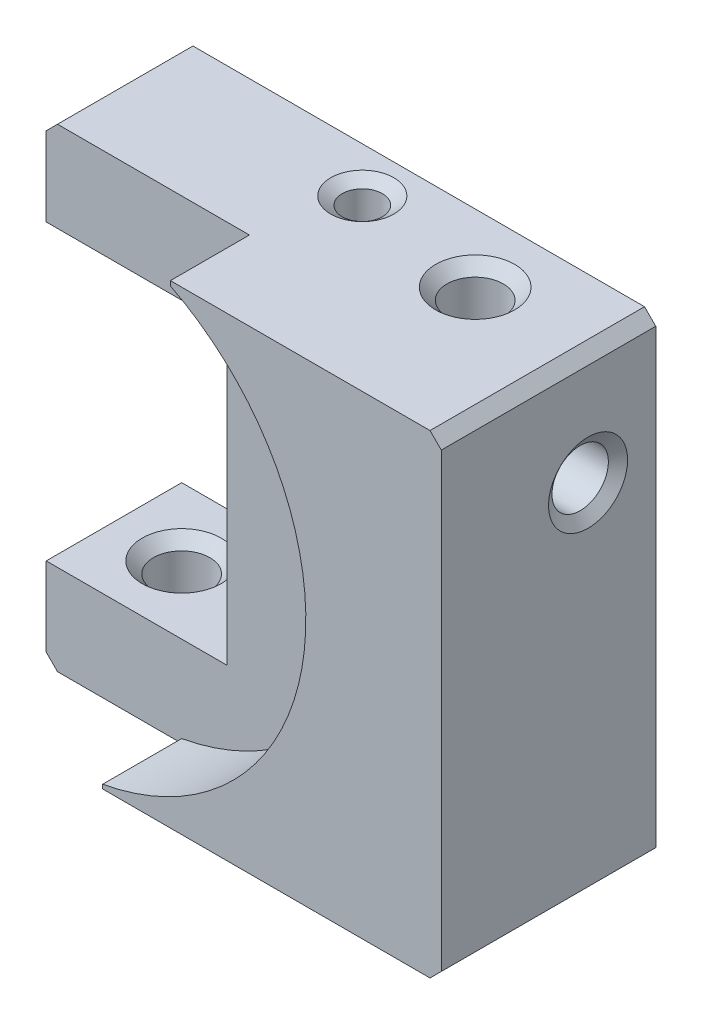
ISO-10303-21;
HEADER;
FILE_DESCRIPTION(('STEP AP214'),'2;1');
FILE_NAME('part.step','',(''),(''),'','','');
FILE_SCHEMA(('AUTOMOTIVE_DESIGN { 1 0 10303 214 1 1 1 1 }'));
ENDSEC;
DATA;
#1=APPLICATION_CONTEXT('core data for automotive mechanical design processes');
#2=APPLICATION_PROTOCOL_DEFINITION('international standard','automotive_design',2000,#1);
#3=PRODUCT_CONTEXT('',#1,'mechanical');
#4=PRODUCT('Part','Part','',(#3));
#5=PRODUCT_RELATED_PRODUCT_CATEGORY('part','',(#4));
#6=PRODUCT_DEFINITION_FORMATION('','',#4);
#7=PRODUCT_DEFINITION_CONTEXT('part definition',#1,'design');
#8=PRODUCT_DEFINITION('design','',#6,#7);
#9=PRODUCT_DEFINITION_SHAPE('','',#8);
#10=(LENGTH_UNIT() NAMED_UNIT(*) SI_UNIT(.MILLI.,.METRE.));
#11=(NAMED_UNIT(*) PLANE_ANGLE_UNIT() SI_UNIT($,.RADIAN.));
#12=(NAMED_UNIT(*) SI_UNIT($,.STERADIAN.) SOLID_ANGLE_UNIT());
#13=UNCERTAINTY_MEASURE_WITH_UNIT(LENGTH_MEASURE(1.E-05),#10,'distance_accuracy_value','');
#14=(GEOMETRIC_REPRESENTATION_CONTEXT(3) GLOBAL_UNCERTAINTY_ASSIGNED_CONTEXT((#13)) GLOBAL_UNIT_ASSIGNED_CONTEXT((#10,
#11,#12)) REPRESENTATION_CONTEXT('',''));
#15=CARTESIAN_POINT('',(0.,0.,0.));
#16=DIRECTION('',(0.,0.,1.));
#17=DIRECTION('',(1.,0.,0.));
#18=AXIS2_PLACEMENT_3D('',#15,#16,#17);
#19=CARTESIAN_POINT('',(-10.5,-10.5,9.5));
#20=DIRECTION('',(0.,1.,0.));
#21=DIRECTION('',(0.,0.,1.));
#22=AXIS2_PLACEMENT_3D('',#19,#20,#21);
#23=PLANE('',#22);
#24=CARTESIAN_POINT('',(5.5,-10.5,3.));
#25=DIRECTION('',(0.,-1.,0.));
#26=DIRECTION('',(0.,0.,-1.));
#27=AXIS2_PLACEMENT_3D('',#24,#25,#26);
#28=CIRCLE('',#27,1.75);
#29=CARTESIAN_POINT('',(5.5,-10.5,1.25));
#30=VERTEX_POINT('',#29);
#31=EDGE_CURVE('E170',#30,#30,#28,.T.);
#32=ORIENTED_EDGE('',*,*,#31,.F.);
#33=EDGE_LOOP('',(#32));
#34=FACE_BOUND('',#33,.T.);
#35=DIRECTION('',(1.,0.,0.));
#36=VECTOR('',#35,1.);
#37=CARTESIAN_POINT('',(-10.5,-10.5,0.));
#38=LINE('',#37,#36);
#39=CARTESIAN_POINT('',(-10.,-10.5,0.));
#40=VERTEX_POINT('',#39);
#41=CARTESIAN_POINT('',(10.,-10.5,0.));
#42=VERTEX_POINT('',#41);
#43=EDGE_CURVE('E238',#40,#42,#38,.T.);
#44=ORIENTED_EDGE('',*,*,#43,.T.);
#45=DIRECTION('',(0.,0.,1.));
#46=VECTOR('',#45,1.);
#47=CARTESIAN_POINT('',(10.,-10.5,9.5));
#48=LINE('',#47,#46);
#49=CARTESIAN_POINT('',(9.99999999999999,-10.5,9.5));
#50=VERTEX_POINT('',#49);
#51=EDGE_CURVE('E278',#42,#50,#48,.T.);
#52=ORIENTED_EDGE('',*,*,#51,.T.);
#53=DIRECTION('',(1.,0.,0.));
#54=VECTOR('',#53,1.);
#55=CARTESIAN_POINT('',(-10.5,-10.5,9.5));
#56=LINE('',#55,#54);
#57=CARTESIAN_POINT('',(-4.5,-10.5,9.5));
#58=VERTEX_POINT('',#57);
#59=EDGE_CURVE('E240',#58,#50,#56,.T.);
#60=ORIENTED_EDGE('',*,*,#59,.F.);
#61=DIRECTION('',(0.,0.,1.));
#62=VECTOR('',#61,1.);
#63=CARTESIAN_POINT('',(-4.5,-10.5,6.));
#64=LINE('',#63,#62);
#65=CARTESIAN_POINT('',(-4.5,-10.5,6.));
#66=VERTEX_POINT('',#65);
#67=EDGE_CURVE('E224',#66,#58,#64,.T.);
#68=ORIENTED_EDGE('',*,*,#67,.F.);
#69=DIRECTION('',(1.,0.,0.));
#70=VECTOR('',#69,1.);
#71=CARTESIAN_POINT('',(0.,-10.5,6.));
#72=LINE('',#71,#70);
#73=CARTESIAN_POINT('',(-10.,-10.5,6.));
#74=VERTEX_POINT('',#73);
#75=EDGE_CURVE('E214',#74,#66,#72,.T.);
#76=ORIENTED_EDGE('',*,*,#75,.F.);
#77=DIRECTION('',(0.,0.,-1.));
#78=VECTOR('',#77,1.);
#79=CARTESIAN_POINT('',(-10.,-10.5,9.5));
#80=LINE('',#79,#78);
#81=EDGE_CURVE('E275',#74,#40,#80,.T.);
#82=ORIENTED_EDGE('',*,*,#81,.T.);
#83=EDGE_LOOP('',(#44,#52,#60,#68,#76,#82));
#84=FACE_BOUND('',#83,.T.);
#85=CARTESIAN_POINT('',(-7.5,-10.5,3.));
#86=DIRECTION('',(0.,-1.,0.));
#87=DIRECTION('',(0.,0.,-1.));
#88=AXIS2_PLACEMENT_3D('',#85,#86,#87);
#89=CIRCLE('',#88,1.75);
#90=CARTESIAN_POINT('',(-7.5,-10.5,1.25));
#91=VERTEX_POINT('',#90);
#92=EDGE_CURVE('E429',#91,#91,#89,.T.);
#93=ORIENTED_EDGE('',*,*,#92,.F.);
#94=EDGE_LOOP('',(#93));
#95=FACE_BOUND('',#94,.T.);
#96=ADVANCED_FACE('F34',(#34,#84,#95),#23,.F.);
#97=CARTESIAN_POINT('',(-10.5,-10.5,9.5));
#98=DIRECTION('',(1.,0.,0.));
#99=DIRECTION('',(0.,0.,-1.));
#100=AXIS2_PLACEMENT_3D('',#97,#98,#99);
#101=PLANE('',#100);
#102=DIRECTION('',(0.,-1.,0.));
#103=VECTOR('',#102,1.);
#104=CARTESIAN_POINT('',(-10.5,-23.2414213562373,6.));
#105=LINE('',#104,#103);
#106=CARTESIAN_POINT('',(-10.5,9.99999999999999,6.));
#107=VERTEX_POINT('',#106);
#108=CARTESIAN_POINT('',(-10.5,6.5,6.));
#109=VERTEX_POINT('',#108);
#110=EDGE_CURVE('E212',#107,#109,#105,.T.);
#111=ORIENTED_EDGE('',*,*,#110,.F.);
#112=DIRECTION('',(0.,0.,-1.));
#113=VECTOR('',#112,1.);
#114=CARTESIAN_POINT('',(-10.5,10.,9.5));
#115=LINE('',#114,#113);
#116=CARTESIAN_POINT('',(-10.5,9.99999999999999,0.));
#117=VERTEX_POINT('',#116);
#118=EDGE_CURVE('E289',#107,#117,#115,.T.);
#119=ORIENTED_EDGE('',*,*,#118,.T.);
#120=DIRECTION('',(0.,-1.,0.));
#121=VECTOR('',#120,1.);
#122=CARTESIAN_POINT('',(-10.5,-10.5,0.));
#123=LINE('',#122,#121);
#124=CARTESIAN_POINT('',(-10.5,6.5,0.));
#125=VERTEX_POINT('',#124);
#126=EDGE_CURVE('E250',#117,#125,#123,.T.);
#127=ORIENTED_EDGE('',*,*,#126,.T.);
#128=DIRECTION('',(0.,0.,1.));
#129=VECTOR('',#128,1.);
#130=CARTESIAN_POINT('',(-10.5,6.5,0.));
#131=LINE('',#130,#129);
#132=EDGE_CURVE('E183',#125,#109,#131,.T.);
#133=ORIENTED_EDGE('',*,*,#132,.T.);
#134=EDGE_LOOP('',(#111,#119,#127,#133));
#135=FACE_BOUND('',#134,.T.);
#136=ADVANCED_FACE('F306',(#135),#101,.F.);
#137=CARTESIAN_POINT('',(-10.5,-6.5,0.));
#138=VERTEX_POINT('',#137);
#139=CARTESIAN_POINT('',(-10.5,-10.,0.));
#140=VERTEX_POINT('',#139);
#141=EDGE_CURVE('E249',#138,#140,#123,.T.);
#142=ORIENTED_EDGE('',*,*,#141,.T.);
#143=DIRECTION('',(0.,0.,1.));
#144=VECTOR('',#143,1.);
#145=CARTESIAN_POINT('',(-10.5,-10.,9.5));
#146=LINE('',#145,#144);
#147=CARTESIAN_POINT('',(-10.5,-10.,6.));
#148=VERTEX_POINT('',#147);
#149=EDGE_CURVE('E54',#140,#148,#146,.T.);
#150=ORIENTED_EDGE('',*,*,#149,.T.);
#151=CARTESIAN_POINT('',(-10.5,-6.5,6.));
#152=VERTEX_POINT('',#151);
#153=EDGE_CURVE('E211',#152,#148,#105,.T.);
#154=ORIENTED_EDGE('',*,*,#153,.F.);
#155=DIRECTION('',(0.,0.,1.));
#156=VECTOR('',#155,1.);
#157=CARTESIAN_POINT('',(-10.5,-6.5,0.));
#158=LINE('',#157,#156);
#159=EDGE_CURVE('E190',#138,#152,#158,.T.);
#160=ORIENTED_EDGE('',*,*,#159,.F.);
#161=EDGE_LOOP('',(#142,#150,#154,#160));
#162=FACE_BOUND('',#161,.T.);
#163=ADVANCED_FACE('F343',(#162),#101,.F.);
#164=CARTESIAN_POINT('',(10.5,10.5,0.));
#165=DIRECTION('',(0.,0.,-1.));
#166=DIRECTION('',(-1.,0.,0.));
#167=AXIS2_PLACEMENT_3D('',#164,#165,#166);
#168=PLANE('',#167);
#169=DIRECTION('',(0.,1.,0.));
#170=VECTOR('',#169,1.);
#171=CARTESIAN_POINT('',(10.5,-10.5,0.));
#172=LINE('',#171,#170);
#173=CARTESIAN_POINT('',(10.5,-10.,0.));
#174=VERTEX_POINT('',#173);
#175=CARTESIAN_POINT('',(10.5,10.,0.));
#176=VERTEX_POINT('',#175);
#177=EDGE_CURVE('E226',#174,#176,#172,.T.);
#178=ORIENTED_EDGE('',*,*,#177,.F.);
#179=DIRECTION('',(0.70710678118655,0.707106781186545,0.));
#180=VECTOR('',#179,1.);
#181=CARTESIAN_POINT('',(20.75,0.249999999999929,0.));
#182=LINE('',#181,#180);
#183=EDGE_CURVE('E273',#174,#42,#182,.F.);
#184=ORIENTED_EDGE('',*,*,#183,.T.);
#185=ORIENTED_EDGE('',*,*,#43,.F.);
#186=DIRECTION('',(0.707106781186545,-0.70710678118655,0.));
#187=VECTOR('',#186,1.);
#188=CARTESIAN_POINT('',(-10.2500000000001,-10.2499999999999,0.));
#189=LINE('',#188,#187);
#190=EDGE_CURVE('E267',#40,#140,#189,.F.);
#191=ORIENTED_EDGE('',*,*,#190,.T.);
#192=ORIENTED_EDGE('',*,*,#141,.F.);
#193=DIRECTION('',(-1.,0.,0.));
#194=VECTOR('',#193,1.);
#195=CARTESIAN_POINT('',(-2.5,-6.5,0.));
#196=LINE('',#195,#194);
#197=CARTESIAN_POINT('',(-2.5,-6.5,0.));
#198=VERTEX_POINT('',#197);
#199=EDGE_CURVE('E188',#198,#138,#196,.T.);
#200=ORIENTED_EDGE('',*,*,#199,.F.);
#201=DIRECTION('',(0.,-1.,0.));
#202=VECTOR('',#201,1.);
#203=CARTESIAN_POINT('',(-2.5,6.5,0.));
#204=LINE('',#203,#202);
#205=CARTESIAN_POINT('',(-2.5,6.5,0.));
#206=VERTEX_POINT('',#205);
#207=EDGE_CURVE('E184',#206,#198,#204,.T.);
#208=ORIENTED_EDGE('',*,*,#207,.F.);
#209=DIRECTION('',(1.,0.,0.));
#210=VECTOR('',#209,1.);
#211=CARTESIAN_POINT('',(-10.5,6.5,0.));
#212=LINE('',#211,#210);
#213=EDGE_CURVE('E179',#125,#206,#212,.T.);
#214=ORIENTED_EDGE('',*,*,#213,.F.);
#215=ORIENTED_EDGE('',*,*,#126,.F.);
#216=DIRECTION('',(-0.70710678118655,-0.707106781186545,0.));
#217=VECTOR('',#216,1.);
#218=CARTESIAN_POINT('',(0.250000000000073,20.75,0.));
#219=LINE('',#218,#217);
#220=CARTESIAN_POINT('',(-10.,10.5,0.));
#221=VERTEX_POINT('',#220);
#222=EDGE_CURVE('E269',#117,#221,#219,.F.);
#223=ORIENTED_EDGE('',*,*,#222,.T.);
#224=DIRECTION('',(-1.,0.,0.));
#225=VECTOR('',#224,1.);
#226=CARTESIAN_POINT('',(-10.5,10.5,0.));
#227=LINE('',#226,#225);
#228=CARTESIAN_POINT('',(10.,10.5,0.));
#229=VERTEX_POINT('',#228);
#230=EDGE_CURVE('E246',#229,#221,#227,.T.);
#231=ORIENTED_EDGE('',*,*,#230,.F.);
#232=DIRECTION('',(-0.707106781186545,0.70710678118655,0.));
#233=VECTOR('',#232,1.);
#234=CARTESIAN_POINT('',(10.25,10.25,0.));
#235=LINE('',#234,#233);
#236=EDGE_CURVE('E271',#229,#176,#235,.F.);
#237=ORIENTED_EDGE('',*,*,#236,.T.);
#238=EDGE_LOOP('',(#178,#184,#185,#191,#192,#200,#208,#214,#215,#223,#231,#237));
#239=FACE_BOUND('',#238,.T.);
#240=ADVANCED_FACE('F313',(#239),#168,.T.);
#241=CARTESIAN_POINT('',(0.,-23.2414213562373,6.));
#242=DIRECTION('',(0.,0.,1.));
#243=DIRECTION('',(1.,0.,0.));
#244=AXIS2_PLACEMENT_3D('',#241,#242,#243);
#245=PLANE('',#244);
#246=DIRECTION('',(-1.,0.,0.));
#247=VECTOR('',#246,1.);
#248=CARTESIAN_POINT('',(0.,10.5,6.));
#249=LINE('',#248,#247);
#250=CARTESIAN_POINT('',(-1.5,10.5,6.));
#251=VERTEX_POINT('',#250);
#252=CARTESIAN_POINT('',(-9.99999999999999,10.5,6.));
#253=VERTEX_POINT('',#252);
#254=EDGE_CURVE('E208',#251,#253,#249,.T.);
#255=ORIENTED_EDGE('',*,*,#254,.T.);
#256=DIRECTION('',(0.70710678118655,0.707106781186545,0.));
#257=VECTOR('',#256,1.);
#258=CARTESIAN_POINT('',(-21.8707106781186,-1.37071067811853,6.));
#259=LINE('',#258,#257);
#260=EDGE_CURVE('E294',#253,#107,#259,.F.);
#261=ORIENTED_EDGE('',*,*,#260,.T.);
#262=ORIENTED_EDGE('',*,*,#110,.T.);
#263=DIRECTION('',(1.,0.,0.));
#264=VECTOR('',#263,1.);
#265=CARTESIAN_POINT('',(0.,6.5,6.));
#266=LINE('',#265,#264);
#267=CARTESIAN_POINT('',(-2.5,6.5,6.));
#268=VERTEX_POINT('',#267);
#269=EDGE_CURVE('E259',#109,#268,#266,.T.);
#270=ORIENTED_EDGE('',*,*,#269,.T.);
#271=DIRECTION('',(0.,-1.,0.));
#272=VECTOR('',#271,1.);
#273=CARTESIAN_POINT('',(-2.5,-23.2414213562373,6.));
#274=LINE('',#273,#272);
#275=CARTESIAN_POINT('',(-2.5,-6.5,6.));
#276=VERTEX_POINT('',#275);
#277=EDGE_CURVE('E256',#268,#276,#274,.T.);
#278=ORIENTED_EDGE('',*,*,#277,.T.);
#279=DIRECTION('',(-1.,0.,0.));
#280=VECTOR('',#279,1.);
#281=CARTESIAN_POINT('',(0.,-6.5,6.));
#282=LINE('',#281,#280);
#283=EDGE_CURVE('E243',#276,#152,#282,.T.);
#284=ORIENTED_EDGE('',*,*,#283,.T.);
#285=ORIENTED_EDGE('',*,*,#153,.T.);
#286=DIRECTION('',(-0.707106781186545,0.70710678118655,0.));
#287=VECTOR('',#286,1.);
#288=CARTESIAN_POINT('',(1.37071067811862,-21.8707106781187,6.));
#289=LINE('',#288,#287);
#290=EDGE_CURVE('E292',#148,#74,#289,.F.);
#291=ORIENTED_EDGE('',*,*,#290,.T.);
#292=ORIENTED_EDGE('',*,*,#75,.T.);
#293=DIRECTION('',(0.,-1.,0.));
#294=VECTOR('',#293,1.);
#295=CARTESIAN_POINT('',(-4.5,-23.2414213562373,6.));
#296=LINE('',#295,#294);
#297=CARTESIAN_POINT('',(-4.5,-10.316653826392,6.));
#298=VERTEX_POINT('',#297);
#299=EDGE_CURVE('E198',#298,#66,#296,.T.);
#300=ORIENTED_EDGE('',*,*,#299,.F.);
#301=CARTESIAN_POINT('',(-6.5,0.5,6.));
#302=DIRECTION('',(0.,0.,1.));
#303=DIRECTION('',(1.,0.,0.));
#304=AXIS2_PLACEMENT_3D('',#301,#302,#303);
#305=CIRCLE('',#304,11.);
#306=CARTESIAN_POINT('',(-1.5,10.2979589711327,6.));
#307=VERTEX_POINT('',#306);
#308=EDGE_CURVE('E201',#298,#307,#305,.T.);
#309=ORIENTED_EDGE('',*,*,#308,.T.);
#310=DIRECTION('',(0.,1.,0.));
#311=VECTOR('',#310,1.);
#312=CARTESIAN_POINT('',(-1.5,-23.2414213562373,6.));
#313=LINE('',#312,#311);
#314=EDGE_CURVE('E205',#307,#251,#313,.T.);
#315=ORIENTED_EDGE('',*,*,#314,.T.);
#316=EDGE_LOOP('',(#255,#261,#262,#270,#278,#284,#285,#291,#292,#300,#309,#315));
#317=FACE_BOUND('',#316,.T.);
#318=ADVANCED_FACE('F299',(#317),#245,.T.);
#319=CARTESIAN_POINT('',(10.5,10.5,9.5));
#320=DIRECTION('',(0.,0.,-1.));
#321=DIRECTION('',(-1.,0.,0.));
#322=AXIS2_PLACEMENT_3D('',#319,#320,#321);
#323=PLANE('',#322);
#324=ORIENTED_EDGE('',*,*,#59,.T.);
#325=DIRECTION('',(-0.70710678118655,-0.707106781186545,0.));
#326=VECTOR('',#325,1.);
#327=CARTESIAN_POINT('',(10.5,-10.,9.5));
#328=LINE('',#327,#326);
#329=CARTESIAN_POINT('',(10.5,-10.,9.5));
#330=VERTEX_POINT('',#329);
#331=EDGE_CURVE('E282',#50,#330,#328,.F.);
#332=ORIENTED_EDGE('',*,*,#331,.T.);
#333=DIRECTION('',(0.,1.,0.));
#334=VECTOR('',#333,1.);
#335=CARTESIAN_POINT('',(10.5,-10.5,9.5));
#336=LINE('',#335,#334);
#337=CARTESIAN_POINT('',(10.5,9.99999999999999,9.5));
#338=VERTEX_POINT('',#337);
#339=EDGE_CURVE('E234',#330,#338,#336,.T.);
#340=ORIENTED_EDGE('',*,*,#339,.T.);
#341=DIRECTION('',(0.707106781186545,-0.70710678118655,0.));
#342=VECTOR('',#341,1.);
#343=CARTESIAN_POINT('',(10.,10.5,9.5));
#344=LINE('',#343,#342);
#345=CARTESIAN_POINT('',(10.,10.5,9.5));
#346=VERTEX_POINT('',#345);
#347=EDGE_CURVE('E280',#338,#346,#344,.F.);
#348=ORIENTED_EDGE('',*,*,#347,.T.);
#349=DIRECTION('',(-1.,0.,0.));
#350=VECTOR('',#349,1.);
#351=CARTESIAN_POINT('',(-10.5,10.5,9.5));
#352=LINE('',#351,#350);
#353=CARTESIAN_POINT('',(-1.5,10.5,9.5));
#354=VERTEX_POINT('',#353);
#355=EDGE_CURVE('E237',#346,#354,#352,.T.);
#356=ORIENTED_EDGE('',*,*,#355,.T.);
#357=DIRECTION('',(0.,1.,0.));
#358=VECTOR('',#357,1.);
#359=CARTESIAN_POINT('',(-1.5,-23.2414213562373,9.5));
#360=LINE('',#359,#358);
#361=CARTESIAN_POINT('',(-1.5,10.2979589711327,9.5));
#362=VERTEX_POINT('',#361);
#363=EDGE_CURVE('E202',#362,#354,#360,.T.);
#364=ORIENTED_EDGE('',*,*,#363,.F.);
#365=CARTESIAN_POINT('',(-6.5,0.5,9.5));
#366=DIRECTION('',(0.,0.,1.));
#367=DIRECTION('',(1.,0.,0.));
#368=AXIS2_PLACEMENT_3D('',#365,#366,#367);
#369=CIRCLE('',#368,11.);
#370=CARTESIAN_POINT('',(-4.5,-10.316653826392,9.5));
#371=VERTEX_POINT('',#370);
#372=EDGE_CURVE('E219',#371,#362,#369,.T.);
#373=ORIENTED_EDGE('',*,*,#372,.F.);
#374=DIRECTION('',(0.,-1.,0.));
#375=VECTOR('',#374,1.);
#376=CARTESIAN_POINT('',(-4.5,-23.2414213562373,9.5));
#377=LINE('',#376,#375);
#378=EDGE_CURVE('E182',#371,#58,#377,.T.);
#379=ORIENTED_EDGE('',*,*,#378,.T.);
#380=EDGE_LOOP('',(#324,#332,#340,#348,#356,#364,#373,#379));
#381=FACE_BOUND('',#380,.T.);
#382=ADVANCED_FACE('F383',(#381),#323,.F.);
#383=CARTESIAN_POINT('',(10.5,-10.5,9.5));
#384=DIRECTION('',(-1.,0.,0.));
#385=DIRECTION('',(0.,0.,1.));
#386=AXIS2_PLACEMENT_3D('',#383,#384,#385);
#387=PLANE('',#386);
#388=CARTESIAN_POINT('',(10.5,5.5,3.));
#389=DIRECTION('',(1.,0.,0.));
#390=DIRECTION('',(0.,0.,-1.));
#391=AXIS2_PLACEMENT_3D('',#388,#389,#390);
#392=CIRCLE('',#391,1.75);
#393=CARTESIAN_POINT('',(10.5,5.5,1.25));
#394=VERTEX_POINT('',#393);
#395=EDGE_CURVE('E462',#394,#394,#392,.T.);
#396=ORIENTED_EDGE('',*,*,#395,.F.);
#397=EDGE_LOOP('',(#396));
#398=FACE_BOUND('',#397,.T.);
#399=ORIENTED_EDGE('',*,*,#339,.F.);
#400=DIRECTION('',(0.,0.,-1.));
#401=VECTOR('',#400,1.);
#402=CARTESIAN_POINT('',(10.5,-10.,9.5));
#403=LINE('',#402,#401);
#404=EDGE_CURVE('E264',#330,#174,#403,.T.);
#405=ORIENTED_EDGE('',*,*,#404,.T.);
#406=ORIENTED_EDGE('',*,*,#177,.T.);
#407=DIRECTION('',(0.,0.,1.));
#408=VECTOR('',#407,1.);
#409=CARTESIAN_POINT('',(10.5,10.,9.5));
#410=LINE('',#409,#408);
#411=EDGE_CURVE('E262',#176,#338,#410,.T.);
#412=ORIENTED_EDGE('',*,*,#411,.T.);
#413=EDGE_LOOP('',(#399,#405,#406,#412));
#414=FACE_BOUND('',#413,.T.);
#415=ADVANCED_FACE('F325',(#398,#414),#387,.F.);
#416=CARTESIAN_POINT('',(-10.5,10.5,9.5));
#417=DIRECTION('',(0.,-1.,0.));
#418=DIRECTION('',(0.,0.,-1.));
#419=AXIS2_PLACEMENT_3D('',#416,#417,#418);
#420=PLANE('',#419);
#421=CARTESIAN_POINT('',(-0.499999999999992,10.5,1.99999999999999));
#422=DIRECTION('',(0.,1.,0.));
#423=DIRECTION('',(0.,0.,1.));
#424=AXIS2_PLACEMENT_3D('',#421,#422,#423);
#425=CIRCLE('',#424,1.397);
#426=CARTESIAN_POINT('',(-0.499999999999992,10.5,3.397));
#427=VERTEX_POINT('',#426);
#428=EDGE_CURVE('E456',#427,#427,#425,.T.);
#429=ORIENTED_EDGE('',*,*,#428,.F.);
#430=EDGE_LOOP('',(#429));
#431=FACE_BOUND('',#430,.T.);
#432=CARTESIAN_POINT('',(5.5,10.5,3.));
#433=DIRECTION('',(0.,-1.,0.));
#434=DIRECTION('',(0.,0.,-1.));
#435=AXIS2_PLACEMENT_3D('',#432,#433,#434);
#436=CIRCLE('',#435,1.74999999999999);
#437=CARTESIAN_POINT('',(5.5,10.5,1.25));
#438=VERTEX_POINT('',#437);
#439=EDGE_CURVE('E175',#438,#438,#436,.T.);
#440=ORIENTED_EDGE('',*,*,#439,.T.);
#441=EDGE_LOOP('',(#440));
#442=FACE_BOUND('',#441,.T.);
#443=ORIENTED_EDGE('',*,*,#355,.F.);
#444=DIRECTION('',(0.,0.,-1.));
#445=VECTOR('',#444,1.);
#446=CARTESIAN_POINT('',(10.,10.5,9.5));
#447=LINE('',#446,#445);
#448=EDGE_CURVE('E286',#346,#229,#447,.T.);
#449=ORIENTED_EDGE('',*,*,#448,.T.);
#450=ORIENTED_EDGE('',*,*,#230,.T.);
#451=DIRECTION('',(0.,0.,1.));
#452=VECTOR('',#451,1.);
#453=CARTESIAN_POINT('',(-10.,10.5,9.5));
#454=LINE('',#453,#452);
#455=EDGE_CURVE('E284',#221,#253,#454,.T.);
#456=ORIENTED_EDGE('',*,*,#455,.T.);
#457=ORIENTED_EDGE('',*,*,#254,.F.);
#458=DIRECTION('',(0.,0.,1.));
#459=VECTOR('',#458,1.);
#460=CARTESIAN_POINT('',(-1.5,10.5,6.));
#461=LINE('',#460,#459);
#462=EDGE_CURVE('E227',#251,#354,#461,.T.);
#463=ORIENTED_EDGE('',*,*,#462,.T.);
#464=EDGE_LOOP('',(#443,#449,#450,#456,#457,#463));
#465=FACE_BOUND('',#464,.T.);
#466=ADVANCED_FACE('F317',(#431,#442,#465),#420,.F.);
#467=CARTESIAN_POINT('',(-4.5,-23.2414213562373,6.));
#468=DIRECTION('',(-1.,0.,0.));
#469=DIRECTION('',(0.,0.,1.));
#470=AXIS2_PLACEMENT_3D('',#467,#468,#469);
#471=PLANE('',#470);
#472=ORIENTED_EDGE('',*,*,#378,.F.);
#473=DIRECTION('',(0.,0.,1.));
#474=VECTOR('',#473,1.);
#475=CARTESIAN_POINT('',(-4.5,-10.316653826392,6.));
#476=LINE('',#475,#474);
#477=EDGE_CURVE('E216',#298,#371,#476,.T.);
#478=ORIENTED_EDGE('',*,*,#477,.F.);
#479=ORIENTED_EDGE('',*,*,#299,.T.);
#480=ORIENTED_EDGE('',*,*,#67,.T.);
#481=EDGE_LOOP('',(#472,#478,#479,#480));
#482=FACE_BOUND('',#481,.T.);
#483=ADVANCED_FACE('F379',(#482),#471,.T.);
#484=CARTESIAN_POINT('',(-1.5,-23.2414213562373,6.));
#485=DIRECTION('',(1.,0.,0.));
#486=DIRECTION('',(0.,0.,-1.));
#487=AXIS2_PLACEMENT_3D('',#484,#485,#486);
#488=PLANE('',#487);
#489=ORIENTED_EDGE('',*,*,#363,.T.);
#490=ORIENTED_EDGE('',*,*,#462,.F.);
#491=ORIENTED_EDGE('',*,*,#314,.F.);
#492=DIRECTION('',(0.,0.,1.));
#493=VECTOR('',#492,1.);
#494=CARTESIAN_POINT('',(-1.5,10.2979589711327,6.));
#495=LINE('',#494,#493);
#496=EDGE_CURVE('E230',#307,#362,#495,.T.);
#497=ORIENTED_EDGE('',*,*,#496,.T.);
#498=EDGE_LOOP('',(#489,#490,#491,#497));
#499=FACE_BOUND('',#498,.T.);
#500=ADVANCED_FACE('F359',(#499),#488,.F.);
#501=CARTESIAN_POINT('',(-6.5,0.5,6.));
#502=DIRECTION('',(0.,0.,1.));
#503=DIRECTION('',(1.,0.,0.));
#504=AXIS2_PLACEMENT_3D('',#501,#502,#503);
#505=CYLINDRICAL_SURFACE('',#504,11.);
#506=ORIENTED_EDGE('',*,*,#372,.T.);
#507=ORIENTED_EDGE('',*,*,#496,.F.);
#508=ORIENTED_EDGE('',*,*,#308,.F.);
#509=ORIENTED_EDGE('',*,*,#477,.T.);
#510=EDGE_LOOP('',(#506,#507,#508,#509));
#511=FACE_BOUND('',#510,.T.);
#512=ADVANCED_FACE('F352',(#511),#505,.F.);
#513=CARTESIAN_POINT('',(-10.5,6.5,0.));
#514=DIRECTION('',(0.,-1.,0.));
#515=DIRECTION('',(1.,0.,0.));
#516=AXIS2_PLACEMENT_3D('',#513,#514,#515);
#517=PLANE('',#516);
#518=ORIENTED_EDGE('',*,*,#269,.F.);
#519=ORIENTED_EDGE('',*,*,#132,.F.);
#520=ORIENTED_EDGE('',*,*,#213,.T.);
#521=DIRECTION('',(0.,0.,1.));
#522=VECTOR('',#521,1.);
#523=CARTESIAN_POINT('',(-2.5,6.5,0.));
#524=LINE('',#523,#522);
#525=EDGE_CURVE('E187',#206,#268,#524,.T.);
#526=ORIENTED_EDGE('',*,*,#525,.T.);
#527=EDGE_LOOP('',(#518,#519,#520,#526));
#528=FACE_BOUND('',#527,.T.);
#529=ADVANCED_FACE('F349',(#528),#517,.T.);
#530=CARTESIAN_POINT('',(-2.5,6.5,0.));
#531=DIRECTION('',(-1.,0.,0.));
#532=DIRECTION('',(0.,-1.,0.));
#533=AXIS2_PLACEMENT_3D('',#530,#531,#532);
#534=PLANE('',#533);
#535=ORIENTED_EDGE('',*,*,#277,.F.);
#536=ORIENTED_EDGE('',*,*,#525,.F.);
#537=ORIENTED_EDGE('',*,*,#207,.T.);
#538=DIRECTION('',(0.,0.,1.));
#539=VECTOR('',#538,1.);
#540=CARTESIAN_POINT('',(-2.5,-6.5,0.));
#541=LINE('',#540,#539);
#542=EDGE_CURVE('E172',#198,#276,#541,.T.);
#543=ORIENTED_EDGE('',*,*,#542,.T.);
#544=EDGE_LOOP('',(#535,#536,#537,#543));
#545=FACE_BOUND('',#544,.T.);
#546=ADVANCED_FACE('F347',(#545),#534,.T.);
#547=CARTESIAN_POINT('',(-2.5,-6.5,0.));
#548=DIRECTION('',(0.,1.,0.));
#549=DIRECTION('',(0.,0.,1.));
#550=AXIS2_PLACEMENT_3D('',#547,#548,#549);
#551=PLANE('',#550);
#552=CARTESIAN_POINT('',(-7.5,-6.5,3.));
#553=DIRECTION('',(0.,-1.,0.));
#554=DIRECTION('',(0.,0.,-1.));
#555=AXIS2_PLACEMENT_3D('',#552,#553,#554);
#556=CIRCLE('',#555,1.75);
#557=CARTESIAN_POINT('',(-7.5,-6.5,1.25));
#558=VERTEX_POINT('',#557);
#559=EDGE_CURVE('E428',#558,#558,#556,.T.);
#560=ORIENTED_EDGE('',*,*,#559,.T.);
#561=EDGE_LOOP('',(#560));
#562=FACE_BOUND('',#561,.T.);
#563=ORIENTED_EDGE('',*,*,#283,.F.);
#564=ORIENTED_EDGE('',*,*,#542,.F.);
#565=ORIENTED_EDGE('',*,*,#199,.T.);
#566=ORIENTED_EDGE('',*,*,#159,.T.);
#567=EDGE_LOOP('',(#563,#564,#565,#566));
#568=FACE_BOUND('',#567,.T.);
#569=ADVANCED_FACE('F345',(#562,#568),#551,.T.);
#570=CARTESIAN_POINT('',(5.5,10.,3.));
#571=DIRECTION('',(0.,1.,0.));
#572=DIRECTION('',(0.,0.,1.));
#573=AXIS2_PLACEMENT_3D('',#570,#571,#572);
#574=CONICAL_SURFACE('',#573,1.25,0.785398163397446);
#575=ORIENTED_EDGE('',*,*,#439,.F.);
#576=EDGE_LOOP('',(#575));
#577=FACE_BOUND('',#576,.T.);
#578=CARTESIAN_POINT('',(5.5,10.,3.));
#579=DIRECTION('',(0.,-1.,0.));
#580=DIRECTION('',(0.,0.,-1.));
#581=AXIS2_PLACEMENT_3D('',#578,#579,#580);
#582=CIRCLE('',#581,1.25);
#583=CARTESIAN_POINT('',(5.5,10.,1.75));
#584=VERTEX_POINT('',#583);
#585=EDGE_CURVE('E165',#584,#584,#582,.T.);
#586=ORIENTED_EDGE('',*,*,#585,.T.);
#587=EDGE_LOOP('',(#586));
#588=FACE_BOUND('',#587,.T.);
#589=ADVANCED_FACE('F160',(#577,#588),#574,.F.);
#590=CARTESIAN_POINT('',(5.5,-10.5,3.));
#591=DIRECTION('',(0.,-1.,0.));
#592=DIRECTION('',(0.,0.,-1.));
#593=AXIS2_PLACEMENT_3D('',#590,#591,#592);
#594=CYLINDRICAL_SURFACE('',#593,1.25);
#595=CARTESIAN_POINT('',(5.5,5.5,3.));
#596=DIRECTION('',(-0.707106781186547,-0.707106781186547,0.));
#597=DIRECTION('',(0.707106781186547,-0.707106781186547,0.));
#598=AXIS2_PLACEMENT_3D('',#595,#596,#597);
#599=ELLIPSE('',#598,1.76776695296637,1.25);
#600=CARTESIAN_POINT('',(5.5,5.5,4.25));
#601=VERTEX_POINT('',#600);
#602=CARTESIAN_POINT('',(5.5,5.5,1.75));
#603=VERTEX_POINT('',#602);
#604=EDGE_CURVE('E42',#601,#603,#599,.F.);
#605=ORIENTED_EDGE('',*,*,#604,.T.);
#606=CARTESIAN_POINT('',(5.5,5.5,3.));
#607=DIRECTION('',(0.707106781186547,-0.707106781186547,0.));
#608=DIRECTION('',(-0.707106781186547,-0.707106781186547,0.));
#609=AXIS2_PLACEMENT_3D('',#606,#607,#608);
#610=ELLIPSE('',#609,1.76776695296637,1.25);
#611=EDGE_CURVE('E11',#603,#601,#610,.T.);
#612=ORIENTED_EDGE('',*,*,#611,.T.);
#613=EDGE_LOOP('',(#605,#612));
#614=FACE_BOUND('',#613,.T.);
#615=ORIENTED_EDGE('',*,*,#585,.F.);
#616=EDGE_LOOP('',(#615));
#617=FACE_BOUND('',#616,.T.);
#618=CARTESIAN_POINT('',(5.5,-10.1498962308951,3.));
#619=DIRECTION('',(0.,-1.,0.));
#620=DIRECTION('',(0.,0.,-1.));
#621=AXIS2_PLACEMENT_3D('',#618,#619,#620);
#622=CIRCLE('',#621,1.25);
#623=CARTESIAN_POINT('',(5.5,-10.1498962308951,1.75));
#624=VERTEX_POINT('',#623);
#625=EDGE_CURVE('E168',#624,#624,#622,.T.);
#626=ORIENTED_EDGE('',*,*,#625,.T.);
#627=EDGE_LOOP('',(#626));
#628=FACE_BOUND('',#627,.T.);
#629=ADVANCED_FACE('F156',(#614,#617,#628),#594,.F.);
#630=CARTESIAN_POINT('',(5.5,-10.5,3.));
#631=DIRECTION('',(0.,-1.,0.));
#632=DIRECTION('',(0.,0.,-1.));
#633=AXIS2_PLACEMENT_3D('',#630,#631,#632);
#634=CONICAL_SURFACE('',#633,1.75,0.959931088596879);
#635=ORIENTED_EDGE('',*,*,#625,.F.);
#636=EDGE_LOOP('',(#635));
#637=FACE_BOUND('',#636,.T.);
#638=ORIENTED_EDGE('',*,*,#31,.T.);
#639=EDGE_LOOP('',(#638));
#640=FACE_BOUND('',#639,.T.);
#641=ADVANCED_FACE('F159',(#637,#640),#634,.F.);
#642=CARTESIAN_POINT('',(-7.5,-7.,3.));
#643=DIRECTION('',(0.,1.,0.));
#644=DIRECTION('',(0.,0.,1.));
#645=AXIS2_PLACEMENT_3D('',#642,#643,#644);
#646=CONICAL_SURFACE('',#645,1.25,0.78539816339745);
#647=ORIENTED_EDGE('',*,*,#559,.F.);
#648=EDGE_LOOP('',(#647));
#649=FACE_BOUND('',#648,.T.);
#650=CARTESIAN_POINT('',(-7.5,-7.,3.));
#651=DIRECTION('',(0.,-1.,0.));
#652=DIRECTION('',(0.,0.,-1.));
#653=AXIS2_PLACEMENT_3D('',#650,#651,#652);
#654=CIRCLE('',#653,1.25);
#655=CARTESIAN_POINT('',(-7.5,-7.,1.75));
#656=VERTEX_POINT('',#655);
#657=EDGE_CURVE('E442',#656,#656,#654,.T.);
#658=ORIENTED_EDGE('',*,*,#657,.T.);
#659=EDGE_LOOP('',(#658));
#660=FACE_BOUND('',#659,.T.);
#661=ADVANCED_FACE('F415',(#649,#660),#646,.F.);
#662=CARTESIAN_POINT('',(-7.5,-10.5,3.));
#663=DIRECTION('',(0.,-1.,0.));
#664=DIRECTION('',(0.,0.,-1.));
#665=AXIS2_PLACEMENT_3D('',#662,#663,#664);
#666=CYLINDRICAL_SURFACE('',#665,1.25);
#667=ORIENTED_EDGE('',*,*,#657,.F.);
#668=EDGE_LOOP('',(#667));
#669=FACE_BOUND('',#668,.T.);
#670=CARTESIAN_POINT('',(-7.5,-10.1498962308951,3.));
#671=DIRECTION('',(0.,-1.,0.));
#672=DIRECTION('',(0.,0.,-1.));
#673=AXIS2_PLACEMENT_3D('',#670,#671,#672);
#674=CIRCLE('',#673,1.25);
#675=CARTESIAN_POINT('',(-7.5,-10.1498962308951,1.75));
#676=VERTEX_POINT('',#675);
#677=EDGE_CURVE('E433',#676,#676,#674,.T.);
#678=ORIENTED_EDGE('',*,*,#677,.T.);
#679=EDGE_LOOP('',(#678));
#680=FACE_BOUND('',#679,.T.);
#681=ADVANCED_FACE('F411',(#669,#680),#666,.F.);
#682=CARTESIAN_POINT('',(-7.5,-10.5,3.));
#683=DIRECTION('',(0.,-1.,0.));
#684=DIRECTION('',(0.,0.,-1.));
#685=AXIS2_PLACEMENT_3D('',#682,#683,#684);
#686=CONICAL_SURFACE('',#685,1.75,0.959931088596879);
#687=ORIENTED_EDGE('',*,*,#677,.F.);
#688=EDGE_LOOP('',(#687));
#689=FACE_BOUND('',#688,.T.);
#690=ORIENTED_EDGE('',*,*,#92,.T.);
#691=EDGE_LOOP('',(#690));
#692=FACE_BOUND('',#691,.T.);
#693=ADVANCED_FACE('F387',(#689,#692),#686,.F.);
#694=CARTESIAN_POINT('',(10.5,-10.,9.5));
#695=DIRECTION('',(-0.707106781186545,0.70710678118655,0.));
#696=DIRECTION('',(-0.70710678118655,-0.707106781186545,0.));
#697=AXIS2_PLACEMENT_3D('',#694,#695,#696);
#698=PLANE('',#697);
#699=ORIENTED_EDGE('',*,*,#331,.F.);
#700=ORIENTED_EDGE('',*,*,#51,.F.);
#701=ORIENTED_EDGE('',*,*,#183,.F.);
#702=ORIENTED_EDGE('',*,*,#404,.F.);
#703=EDGE_LOOP('',(#699,#700,#701,#702));
#704=FACE_BOUND('',#703,.T.);
#705=ADVANCED_FACE('F329',(#704),#698,.F.);
#706=CARTESIAN_POINT('',(10.,10.5,9.5));
#707=DIRECTION('',(-0.70710678118655,-0.707106781186545,0.));
#708=DIRECTION('',(0.707106781186545,-0.70710678118655,0.));
#709=AXIS2_PLACEMENT_3D('',#706,#707,#708);
#710=PLANE('',#709);
#711=ORIENTED_EDGE('',*,*,#347,.F.);
#712=ORIENTED_EDGE('',*,*,#411,.F.);
#713=ORIENTED_EDGE('',*,*,#236,.F.);
#714=ORIENTED_EDGE('',*,*,#448,.F.);
#715=EDGE_LOOP('',(#711,#712,#713,#714));
#716=FACE_BOUND('',#715,.T.);
#717=ADVANCED_FACE('F321',(#716),#710,.F.);
#718=CARTESIAN_POINT('',(-10.5,10.,9.5));
#719=DIRECTION('',(0.707106781186545,-0.70710678118655,0.));
#720=DIRECTION('',(0.70710678118655,0.707106781186545,0.));
#721=AXIS2_PLACEMENT_3D('',#718,#719,#720);
#722=PLANE('',#721);
#723=ORIENTED_EDGE('',*,*,#260,.F.);
#724=ORIENTED_EDGE('',*,*,#455,.F.);
#725=ORIENTED_EDGE('',*,*,#222,.F.);
#726=ORIENTED_EDGE('',*,*,#118,.F.);
#727=EDGE_LOOP('',(#723,#724,#725,#726));
#728=FACE_BOUND('',#727,.T.);
#729=ADVANCED_FACE('F309',(#728),#722,.F.);
#730=CARTESIAN_POINT('',(-10.,-10.5,9.5));
#731=DIRECTION('',(0.70710678118655,0.707106781186545,0.));
#732=DIRECTION('',(-0.707106781186545,0.70710678118655,0.));
#733=AXIS2_PLACEMENT_3D('',#730,#731,#732);
#734=PLANE('',#733);
#735=ORIENTED_EDGE('',*,*,#290,.F.);
#736=ORIENTED_EDGE('',*,*,#149,.F.);
#737=ORIENTED_EDGE('',*,*,#190,.F.);
#738=ORIENTED_EDGE('',*,*,#81,.F.);
#739=EDGE_LOOP('',(#735,#736,#737,#738));
#740=FACE_BOUND('',#739,.T.);
#741=ADVANCED_FACE('F36',(#740),#734,.F.);
#742=CARTESIAN_POINT('',(-0.499999999999992,2.23,1.99999999999999));
#743=DIRECTION('',(0.,1.,0.));
#744=DIRECTION('',(0.,0.,1.));
#745=AXIS2_PLACEMENT_3D('',#742,#743,#744);
#746=CONICAL_SURFACE('',#745,0.888999999999998,1.02974425867665);
#747=CARTESIAN_POINT('',(-0.499999999999994,1.6958349096845,1.99999999999999));
#748=VERTEX_POINT('',#747);
#749=VERTEX_LOOP('',#748);
#750=FACE_BOUND('',#749,.T.);
#751=CARTESIAN_POINT('',(-0.499999999999992,2.23,1.99999999999999));
#752=DIRECTION('',(0.,1.,0.));
#753=DIRECTION('',(0.,0.,1.));
#754=AXIS2_PLACEMENT_3D('',#751,#752,#753);
#755=CIRCLE('',#754,0.888999999999998);
#756=CARTESIAN_POINT('',(-0.499999999999992,2.23,2.88899999999999));
#757=VERTEX_POINT('',#756);
#758=EDGE_CURVE('E430',#757,#757,#755,.T.);
#759=ORIENTED_EDGE('',*,*,#758,.T.);
#760=EDGE_LOOP('',(#759));
#761=FACE_BOUND('',#760,.T.);
#762=ADVANCED_FACE('F393',(#750,#761),#746,.F.);
#763=CARTESIAN_POINT('',(-0.499999999999992,10.5,1.99999999999999));
#764=DIRECTION('',(0.,1.,0.));
#765=DIRECTION('',(0.,0.,1.));
#766=AXIS2_PLACEMENT_3D('',#763,#764,#765);
#767=CYLINDRICAL_SURFACE('',#766,0.888999999999994);
#768=ORIENTED_EDGE('',*,*,#758,.F.);
#769=EDGE_LOOP('',(#768));
#770=FACE_BOUND('',#769,.T.);
#771=CARTESIAN_POINT('',(-0.499999999999992,10.1442945705895,1.99999999999999));
#772=DIRECTION('',(0.,1.,0.));
#773=DIRECTION('',(0.,0.,1.));
#774=AXIS2_PLACEMENT_3D('',#771,#772,#773);
#775=CIRCLE('',#774,0.888999999999989);
#776=CARTESIAN_POINT('',(-0.499999999999992,10.1442945705895,2.88899999999998));
#777=VERTEX_POINT('',#776);
#778=EDGE_CURVE('E436',#777,#777,#775,.T.);
#779=ORIENTED_EDGE('',*,*,#778,.T.);
#780=EDGE_LOOP('',(#779));
#781=FACE_BOUND('',#780,.T.);
#782=ADVANCED_FACE('F397',(#770,#781),#767,.F.);
#783=CARTESIAN_POINT('',(-0.499999999999992,10.5,1.99999999999999));
#784=DIRECTION('',(0.,1.,0.));
#785=DIRECTION('',(0.,0.,1.));
#786=AXIS2_PLACEMENT_3D('',#783,#784,#785);
#787=CONICAL_SURFACE('',#786,1.397,0.959931088596871);
#788=ORIENTED_EDGE('',*,*,#778,.F.);
#789=EDGE_LOOP('',(#788));
#790=FACE_BOUND('',#789,.T.);
#791=ORIENTED_EDGE('',*,*,#428,.T.);
#792=EDGE_LOOP('',(#791));
#793=FACE_BOUND('',#792,.T.);
#794=ADVANCED_FACE('F403',(#790,#793),#787,.F.);
#795=CARTESIAN_POINT('',(10.5,5.5,3.));
#796=DIRECTION('',(1.,0.,0.));
#797=DIRECTION('',(0.,0.,-1.));
#798=AXIS2_PLACEMENT_3D('',#795,#796,#797);
#799=CYLINDRICAL_SURFACE('',#798,1.25);
#800=ORIENTED_EDGE('',*,*,#604,.F.);
#801=ORIENTED_EDGE('',*,*,#611,.F.);
#802=EDGE_LOOP('',(#800,#801));
#803=FACE_BOUND('',#802,.T.);
#804=CARTESIAN_POINT('',(10.1498962308951,5.5,3.));
#805=DIRECTION('',(1.,0.,0.));
#806=DIRECTION('',(0.,0.,-1.));
#807=AXIS2_PLACEMENT_3D('',#804,#805,#806);
#808=CIRCLE('',#807,1.25);
#809=CARTESIAN_POINT('',(10.1498962308951,5.5,1.75));
#810=VERTEX_POINT('',#809);
#811=EDGE_CURVE('E459',#810,#810,#808,.T.);
#812=ORIENTED_EDGE('',*,*,#811,.T.);
#813=EDGE_LOOP('',(#812));
#814=FACE_BOUND('',#813,.T.);
#815=ADVANCED_FACE('F153',(#803,#814),#799,.F.);
#816=CARTESIAN_POINT('',(10.5,5.5,3.));
#817=DIRECTION('',(1.,0.,0.));
#818=DIRECTION('',(0.,0.,-1.));
#819=AXIS2_PLACEMENT_3D('',#816,#817,#818);
#820=CONICAL_SURFACE('',#819,1.75,0.959931088596883);
#821=ORIENTED_EDGE('',*,*,#811,.F.);
#822=EDGE_LOOP('',(#821));
#823=FACE_BOUND('',#822,.T.);
#824=ORIENTED_EDGE('',*,*,#395,.T.);
#825=EDGE_LOOP('',(#824));
#826=FACE_BOUND('',#825,.T.);
#827=ADVANCED_FACE('F466',(#823,#826),#820,.F.);
#828=CLOSED_SHELL('',(#96,#136,#163,#240,#318,#382,#415,#466,#483,#500,#512,#529,#546,#569,#589,
#629,#641,#661,#681,#693,#705,#717,#729,#741,#762,#782,#794,#815,#827));
#829=MANIFOLD_SOLID_BREP('B2',#828);
#830=ADVANCED_BREP_SHAPE_REPRESENTATION('',(#18,#829),#14);
#831=SHAPE_DEFINITION_REPRESENTATION(#9,#830);
ENDSEC;
END-ISO-10303-21;
